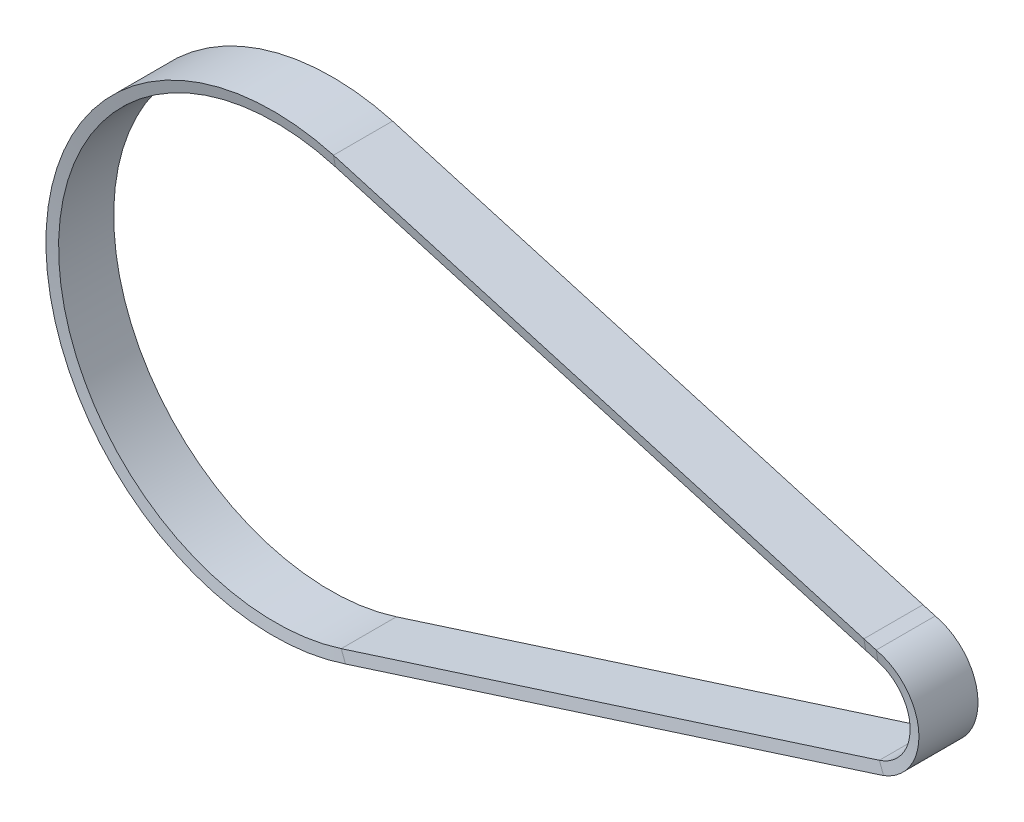
ISO-10303-21;
HEADER;
FILE_DESCRIPTION(('STEP AP214'),'2;1');
FILE_NAME('part.step','',(''),(''),'','','');
FILE_SCHEMA(('AUTOMOTIVE_DESIGN { 1 0 10303 214 1 1 1 1 }'));
ENDSEC;
DATA;
#1=APPLICATION_CONTEXT('core data for automotive mechanical design processes');
#2=APPLICATION_PROTOCOL_DEFINITION('international standard','automotive_design',2000,#1);
#3=PRODUCT_CONTEXT('',#1,'mechanical');
#4=PRODUCT('Part','Part','',(#3));
#5=PRODUCT_RELATED_PRODUCT_CATEGORY('part','',(#4));
#6=PRODUCT_DEFINITION_FORMATION('','',#4);
#7=PRODUCT_DEFINITION_CONTEXT('part definition',#1,'design');
#8=PRODUCT_DEFINITION('design','',#6,#7);
#9=PRODUCT_DEFINITION_SHAPE('','',#8);
#10=(LENGTH_UNIT() NAMED_UNIT(*) SI_UNIT(.MILLI.,.METRE.));
#11=(NAMED_UNIT(*) PLANE_ANGLE_UNIT() SI_UNIT($,.RADIAN.));
#12=(NAMED_UNIT(*) SI_UNIT($,.STERADIAN.) SOLID_ANGLE_UNIT());
#13=UNCERTAINTY_MEASURE_WITH_UNIT(LENGTH_MEASURE(1.E-05),#10,'distance_accuracy_value','');
#14=(GEOMETRIC_REPRESENTATION_CONTEXT(3) GLOBAL_UNCERTAINTY_ASSIGNED_CONTEXT((#13)) GLOBAL_UNIT_ASSIGNED_CONTEXT((#10,
#11,#12)) REPRESENTATION_CONTEXT('',''));
#15=CARTESIAN_POINT('',(0.,0.,0.));
#16=DIRECTION('',(0.,0.,1.));
#17=DIRECTION('',(1.,0.,0.));
#18=AXIS2_PLACEMENT_3D('',#15,#16,#17);
#19=CARTESIAN_POINT('',(6.25963492102954,27.2517322455981,-15.));
#20=DIRECTION('',(0.0505015186430798,0.174359257796911,0.983386213974577));
#21=DIRECTION('',(0.,-0.984642633533098,0.17458202722218));
#22=AXIS2_PLACEMENT_3D('',#19,#20,#21);
#23=PLANE('',#22);
#24=DIRECTION('',(0.,0.984642633533098,-0.17458202722218));
#25=VECTOR('',#24,1.);
#26=CARTESIAN_POINT('',(6.25963492102966,27.2517322455981,-15.));
#27=LINE('',#26,#25);
#28=CARTESIAN_POINT('',(6.25963492102965,21.6117322455981,-14.));
#29=VERTEX_POINT('',#28);
#30=CARTESIAN_POINT('',(6.25963492102965,27.2517322455981,-15.));
#31=VERTEX_POINT('',#30);
#32=EDGE_CURVE('E172',#29,#31,#27,.T.);
#33=ORIENTED_EDGE('',*,*,#32,.F.);
#34=DIRECTION('',(-0.960521433137697,0.2782059964902,0.));
#35=VECTOR('',#34,1.);
#36=CARTESIAN_POINT('',(6.25963492102954,21.6117322455981,-14.));
#37=LINE('',#36,#35);
#38=CARTESIAN_POINT('',(0.,23.4247766096173,-14.));
#39=VERTEX_POINT('',#38);
#40=EDGE_CURVE('E171',#29,#39,#37,.T.);
#41=ORIENTED_EDGE('',*,*,#40,.T.);
#42=DIRECTION('',(0.,0.984642633533098,-0.17458202722218));
#43=VECTOR('',#42,1.);
#44=CARTESIAN_POINT('',(0.,29.0647766096173,-15.));
#45=LINE('',#44,#43);
#46=CARTESIAN_POINT('',(0.,29.0647766096173,-15.));
#47=VERTEX_POINT('',#46);
#48=EDGE_CURVE('E146',#39,#47,#45,.T.);
#49=ORIENTED_EDGE('',*,*,#48,.T.);
#50=DIRECTION('',(-0.960521433137697,0.2782059964902,0.));
#51=VECTOR('',#50,1.);
#52=CARTESIAN_POINT('',(6.25963492102954,27.2517322455981,-15.));
#53=LINE('',#52,#51);
#54=EDGE_CURVE('E176',#31,#47,#53,.T.);
#55=ORIENTED_EDGE('',*,*,#54,.F.);
#56=EDGE_LOOP('',(#33,#41,#49,#55));
#57=FACE_BOUND('',#56,.T.);
#58=ADVANCED_FACE('F38',(#57),#23,.F.);
#59=CARTESIAN_POINT('',(0.,29.0647766096173,-15.));
#60=DIRECTION('',(0.0505015186430798,0.174359257796911,0.983386213974577));
#61=DIRECTION('',(0.,-0.984642633533098,0.17458202722218));
#62=AXIS2_PLACEMENT_3D('',#59,#60,#61);
#63=PLANE('',#62);
#64=DIRECTION('',(-0.960521433137697,0.2782059964902,0.));
#65=VECTOR('',#64,1.);
#66=CARTESIAN_POINT('',(0.,29.0647766096173,-15.));
#67=LINE('',#66,#65);
#68=CARTESIAN_POINT('',(-269.3677602481,107.084614144479,-15.));
#69=VERTEX_POINT('',#68);
#70=EDGE_CURVE('E152',#47,#69,#67,.T.);
#71=ORIENTED_EDGE('',*,*,#70,.F.);
#72=ORIENTED_EDGE('',*,*,#48,.F.);
#73=DIRECTION('',(-0.960521433137697,0.2782059964902,0.));
#74=VECTOR('',#73,1.);
#75=CARTESIAN_POINT('',(0.,23.4247766096173,-14.));
#76=LINE('',#75,#74);
#77=CARTESIAN_POINT('',(-269.3677602481,101.444614144479,-14.));
#78=VERTEX_POINT('',#77);
#79=EDGE_CURVE('E150',#39,#78,#76,.T.);
#80=ORIENTED_EDGE('',*,*,#79,.T.);
#81=DIRECTION('',(0.,0.984642633533098,-0.17458202722218));
#82=VECTOR('',#81,1.);
#83=CARTESIAN_POINT('',(-269.3677602481,107.084614144479,-15.));
#84=LINE('',#83,#82);
#85=EDGE_CURVE('E168',#78,#69,#84,.T.);
#86=ORIENTED_EDGE('',*,*,#85,.T.);
#87=EDGE_LOOP('',(#71,#72,#80,#86));
#88=FACE_BOUND('',#87,.T.);
#89=ADVANCED_FACE('F148',(#88),#63,.F.);
#90=CARTESIAN_POINT('',(0.,29.0647766096173,15.));
#91=DIRECTION('',(-0.2782059964902,-0.960521433137697,0.));
#92=DIRECTION('',(0.960521433137697,-0.2782059964902,0.));
#93=AXIS2_PLACEMENT_3D('',#90,#91,#92);
#94=PLANE('',#93);
#95=DIRECTION('',(-0.960521433137697,0.2782059964902,0.));
#96=VECTOR('',#95,1.);
#97=CARTESIAN_POINT('',(0.,29.0647766096173,15.));
#98=LINE('',#97,#96);
#99=CARTESIAN_POINT('',(0.,29.0647766096173,15.));
#100=VERTEX_POINT('',#99);
#101=CARTESIAN_POINT('',(-269.3677602481,107.084614144479,15.));
#102=VERTEX_POINT('',#101);
#103=EDGE_CURVE('E213',#100,#102,#98,.T.);
#104=ORIENTED_EDGE('',*,*,#103,.F.);
#105=DIRECTION('',(0.,0.,1.));
#106=VECTOR('',#105,1.);
#107=CARTESIAN_POINT('',(0.,29.0647766096173,15.));
#108=LINE('',#107,#106);
#109=EDGE_CURVE('E157',#47,#100,#108,.T.);
#110=ORIENTED_EDGE('',*,*,#109,.F.);
#111=ORIENTED_EDGE('',*,*,#70,.T.);
#112=DIRECTION('',(0.,0.,1.));
#113=VECTOR('',#112,1.);
#114=CARTESIAN_POINT('',(-269.3677602481,107.084614144479,15.));
#115=LINE('',#114,#113);
#116=EDGE_CURVE('E245',#69,#102,#115,.T.);
#117=ORIENTED_EDGE('',*,*,#116,.T.);
#118=EDGE_LOOP('',(#104,#110,#111,#117));
#119=FACE_BOUND('',#118,.T.);
#120=ADVANCED_FACE('F263',(#119),#94,.F.);
#121=CARTESIAN_POINT('',(0.,23.4247766096173,14.));
#122=DIRECTION('',(0.0505015186430798,0.174359257796911,-0.983386213974577));
#123=DIRECTION('',(0.,0.984642633533098,0.17458202722218));
#124=AXIS2_PLACEMENT_3D('',#121,#122,#123);
#125=PLANE('',#124);
#126=DIRECTION('',(-0.960521433137697,0.2782059964902,0.));
#127=VECTOR('',#126,1.);
#128=CARTESIAN_POINT('',(0.,23.4247766096173,14.));
#129=LINE('',#128,#127);
#130=CARTESIAN_POINT('',(0.,23.4247766096173,14.));
#131=VERTEX_POINT('',#130);
#132=CARTESIAN_POINT('',(-269.3677602481,101.444614144479,14.));
#133=VERTEX_POINT('',#132);
#134=EDGE_CURVE('E187',#131,#133,#129,.T.);
#135=ORIENTED_EDGE('',*,*,#134,.F.);
#136=DIRECTION('',(0.,-0.984642633533098,-0.17458202722218));
#137=VECTOR('',#136,1.);
#138=CARTESIAN_POINT('',(0.,23.4247766096173,14.));
#139=LINE('',#138,#137);
#140=EDGE_CURVE('E179',#100,#131,#139,.T.);
#141=ORIENTED_EDGE('',*,*,#140,.F.);
#142=ORIENTED_EDGE('',*,*,#103,.T.);
#143=DIRECTION('',(0.,-0.984642633533098,-0.17458202722218));
#144=VECTOR('',#143,1.);
#145=CARTESIAN_POINT('',(-269.3677602481,101.444614144479,14.));
#146=LINE('',#145,#144);
#147=EDGE_CURVE('E215',#102,#133,#146,.T.);
#148=ORIENTED_EDGE('',*,*,#147,.T.);
#149=EDGE_LOOP('',(#135,#141,#142,#148));
#150=FACE_BOUND('',#149,.T.);
#151=ADVANCED_FACE('F211',(#150),#125,.F.);
#152=CARTESIAN_POINT('',(0.,23.4247766096173,-14.));
#153=DIRECTION('',(0.2782059964902,0.960521433137697,0.));
#154=DIRECTION('',(-0.960521433137697,0.2782059964902,0.));
#155=AXIS2_PLACEMENT_3D('',#152,#153,#154);
#156=PLANE('',#155);
#157=DIRECTION('',(0.,0.,-1.));
#158=VECTOR('',#157,1.);
#159=CARTESIAN_POINT('',(-269.3677602481,101.444614144479,-14.));
#160=LINE('',#159,#158);
#161=EDGE_CURVE('E166',#133,#78,#160,.T.);
#162=ORIENTED_EDGE('',*,*,#161,.T.);
#163=ORIENTED_EDGE('',*,*,#79,.F.);
#164=DIRECTION('',(0.,0.,-1.));
#165=VECTOR('',#164,1.);
#166=CARTESIAN_POINT('',(0.,23.4247766096173,-14.));
#167=LINE('',#166,#165);
#168=EDGE_CURVE('E164',#131,#39,#167,.T.);
#169=ORIENTED_EDGE('',*,*,#168,.F.);
#170=ORIENTED_EDGE('',*,*,#134,.T.);
#171=EDGE_LOOP('',(#162,#163,#169,#170));
#172=FACE_BOUND('',#171,.T.);
#173=ADVANCED_FACE('F162',(#172),#156,.F.);
#174=CARTESIAN_POINT('',(-269.3677602481,101.444614144479,-14.));
#175=CARTESIAN_POINT('',(-346.902912762118,123.901941616827,-14.));
#176=CARTESIAN_POINT('',(-411.09310989075,74.9565636413775,-14.));
#177=CARTESIAN_POINT('',(-409.95957381143,-5.75741611757874,-14.));
#178=CARTESIAN_POINT('',(-408.826037732109,-86.471395876535,-14.));
#179=CARTESIAN_POINT('',(-343.286662806537,-133.594869506326,-14.));
#180=CARTESIAN_POINT('',(-266.412739672123,-108.969042119283,-14.));
#181=CARTESIAN_POINT('',(-269.3677602481,107.084614144479,-15.));
#182=CARTESIAN_POINT('',(-351.041746724327,129.541941616827,-15.));
#183=CARTESIAN_POINT('',(-417.695042729522,77.2704412006036,-15.));
#184=CARTESIAN_POINT('',(-415.354346744557,-7.40241611757875,-15.));
#185=CARTESIAN_POINT('',(-413.013650759592,-92.0752734357611,-15.));
#186=CARTESIAN_POINT('',(-343.574369279463,-140.584631415874,-15.));
#187=CARTESIAN_POINT('',(-263.265788794465,-113.649458785949,-15.));
#188=(BOUNDED_SURFACE() B_SPLINE_SURFACE(1,3,((#174,#175,#176,#177,#178,#179,#180),(#181,#182,
#183,#184,#185,#186,#187)),.UNSPECIFIED.,.F.,.F.,.F.) B_SPLINE_SURFACE_WITH_KNOTS((2,2),(4,3,4),
(0.,1.),(0.,0.5,1.),
.UNSPECIFIED.) GEOMETRIC_REPRESENTATION_ITEM() RATIONAL_B_SPLINE_SURFACE(((1.,0.730079357141269,
0.730079357141269,1.,0.730079357141269,0.730079357141269,1.),(1.,0.730079357141269,
0.730079357141269,1.,0.730079357141269,0.730079357141269,1.))) REPRESENTATION_ITEM('') SURFACE());
#189=CARTESIAN_POINT('',(-299.970419862022,-4.2127435006675,-15.));
#190=DIRECTION('',(0.,0.,1.));
#191=DIRECTION('',(0.265123349571637,0.96421450389004,0.));
#192=AXIS2_PLACEMENT_3D('',#189,#190,#191);
#193=CIRCLE('',#192,115.428006108731);
#194=CARTESIAN_POINT('',(-263.265788794465,-113.649458785949,-15.));
#195=VERTEX_POINT('',#194);
#196=EDGE_CURVE('E131',#69,#195,#193,.T.);
#197=CARTESIAN_POINT('',(-299.970419862022,-4.2127435006675,-14.));
#198=DIRECTION('',(0.,0.,1.));
#199=DIRECTION('',(0.278205996490201,0.960521433137696,0.));
#200=AXIS2_PLACEMENT_3D('',#197,#198,#199);
#201=CIRCLE('',#200,110.);
#202=CARTESIAN_POINT('',(-266.412739672123,-108.969042119282,-14.));
#203=VERTEX_POINT('',#202);
#204=EDGE_CURVE('E186',#78,#203,#201,.T.);
#205=DIRECTION('',(0.549401063790055,-0.817116629911147,-0.17458202722218));
#206=VECTOR('',#205,1.);
#207=CARTESIAN_POINT('',(-263.265788794465,-113.649458785949,-15.));
#208=LINE('',#207,#206);
#209=EDGE_CURVE('E222',#203,#195,#208,.T.);
#210=ORIENTED_EDGE('',*,*,#196,.F.);
#211=ORIENTED_EDGE('',*,*,#85,.F.);
#212=ORIENTED_EDGE('',*,*,#204,.T.);
#213=ORIENTED_EDGE('',*,*,#209,.T.);
#214=EDGE_LOOP('',(#210,#211,#212,#213));
#215=FACE_BOUND('',#214,.T.);
#216=ADVANCED_FACE('F295',(#215),#188,.F.);
#217=CARTESIAN_POINT('',(-299.970419862022,-4.2127435006675,0.));
#218=DIRECTION('',(0.,0.,1.));
#219=DIRECTION('',(1.,0.,0.));
#220=AXIS2_PLACEMENT_3D('',#217,#218,#219);
#221=CYLINDRICAL_SURFACE('',#220,115.428006108731);
#222=CARTESIAN_POINT('',(-299.970419862022,-4.2127435006675,15.));
#223=DIRECTION('',(0.,0.,1.));
#224=DIRECTION('',(0.265123349571637,0.96421450389004,0.));
#225=AXIS2_PLACEMENT_3D('',#222,#223,#224);
#226=CIRCLE('',#225,115.428006108731);
#227=CARTESIAN_POINT('',(-263.265788794465,-113.649458785949,15.));
#228=VERTEX_POINT('',#227);
#229=EDGE_CURVE('E125',#102,#228,#226,.T.);
#230=ORIENTED_EDGE('',*,*,#229,.F.);
#231=ORIENTED_EDGE('',*,*,#116,.F.);
#232=ORIENTED_EDGE('',*,*,#196,.T.);
#233=DIRECTION('',(0.,0.,1.));
#234=VECTOR('',#233,1.);
#235=CARTESIAN_POINT('',(-263.265788794465,-113.649458785949,15.));
#236=LINE('',#235,#234);
#237=EDGE_CURVE('E220',#195,#228,#236,.T.);
#238=ORIENTED_EDGE('',*,*,#237,.T.);
#239=EDGE_LOOP('',(#230,#231,#232,#238));
#240=FACE_BOUND('',#239,.T.);
#241=ADVANCED_FACE('F299',(#240),#221,.T.);
#242=CARTESIAN_POINT('',(-269.3677602481,107.084614144479,15.));
#243=CARTESIAN_POINT('',(-351.041746724327,129.541941616827,15.));
#244=CARTESIAN_POINT('',(-417.695042729522,77.2704412006036,15.));
#245=CARTESIAN_POINT('',(-415.354346744557,-7.40241611757875,15.));
#246=CARTESIAN_POINT('',(-413.013650759592,-92.0752734357611,15.));
#247=CARTESIAN_POINT('',(-343.574369279463,-140.584631415874,15.));
#248=CARTESIAN_POINT('',(-263.265788794465,-113.649458785949,15.));
#249=CARTESIAN_POINT('',(-269.3677602481,101.444614144479,14.));
#250=CARTESIAN_POINT('',(-346.902912762118,123.901941616827,14.));
#251=CARTESIAN_POINT('',(-411.09310989075,74.9565636413775,14.));
#252=CARTESIAN_POINT('',(-409.95957381143,-5.75741611757874,14.));
#253=CARTESIAN_POINT('',(-408.826037732109,-86.471395876535,14.));
#254=CARTESIAN_POINT('',(-343.286662806537,-133.594869506326,14.));
#255=CARTESIAN_POINT('',(-266.412739672123,-108.969042119283,14.));
#256=(BOUNDED_SURFACE() B_SPLINE_SURFACE(1,3,((#242,#243,#244,#245,#246,#247,#248),(#249,#250,
#251,#252,#253,#254,#255)),.UNSPECIFIED.,.F.,.F.,.F.) B_SPLINE_SURFACE_WITH_KNOTS((2,2),(4,3,4),
(0.,1.),(0.,0.5,1.),
.UNSPECIFIED.) GEOMETRIC_REPRESENTATION_ITEM() RATIONAL_B_SPLINE_SURFACE(((1.,0.730079357141269,
0.730079357141269,1.,0.730079357141269,0.730079357141269,1.),(1.,0.730079357141269,
0.730079357141269,1.,0.730079357141269,0.730079357141269,1.))) REPRESENTATION_ITEM('') SURFACE());
#257=CARTESIAN_POINT('',(-299.970419862022,-4.2127435006675,14.));
#258=DIRECTION('',(0.,0.,1.));
#259=DIRECTION('',(0.278205996490201,0.960521433137696,0.));
#260=AXIS2_PLACEMENT_3D('',#257,#258,#259);
#261=CIRCLE('',#260,110.);
#262=CARTESIAN_POINT('',(-266.412739672123,-108.969042119282,14.));
#263=VERTEX_POINT('',#262);
#264=EDGE_CURVE('E221',#133,#263,#261,.T.);
#265=DIRECTION('',(-0.549401063790055,0.817116629911147,-0.17458202722218));
#266=VECTOR('',#265,1.);
#267=CARTESIAN_POINT('',(-266.412739672122,-108.969042119282,14.));
#268=LINE('',#267,#266);
#269=EDGE_CURVE('E191',#228,#263,#268,.T.);
#270=ORIENTED_EDGE('',*,*,#264,.F.);
#271=ORIENTED_EDGE('',*,*,#147,.F.);
#272=ORIENTED_EDGE('',*,*,#229,.T.);
#273=ORIENTED_EDGE('',*,*,#269,.T.);
#274=EDGE_LOOP('',(#270,#271,#272,#273));
#275=FACE_BOUND('',#274,.T.);
#276=ADVANCED_FACE('F310',(#275),#256,.F.);
#277=CARTESIAN_POINT('',(-299.970419862022,-4.2127435006675,0.));
#278=DIRECTION('',(0.,0.,1.));
#279=DIRECTION('',(1.,0.,0.));
#280=AXIS2_PLACEMENT_3D('',#277,#278,#279);
#281=CYLINDRICAL_SURFACE('',#280,110.);
#282=DIRECTION('',(0.,0.,-1.));
#283=VECTOR('',#282,1.);
#284=CARTESIAN_POINT('',(-266.412739672122,-108.969042119282,-14.));
#285=LINE('',#284,#283);
#286=EDGE_CURVE('E188',#263,#203,#285,.T.);
#287=ORIENTED_EDGE('',*,*,#286,.T.);
#288=ORIENTED_EDGE('',*,*,#204,.F.);
#289=ORIENTED_EDGE('',*,*,#161,.F.);
#290=ORIENTED_EDGE('',*,*,#264,.T.);
#291=EDGE_LOOP('',(#287,#288,#289,#290));
#292=FACE_BOUND('',#291,.T.);
#293=ADVANCED_FACE('F293',(#292),#281,.F.);
#294=CARTESIAN_POINT('',(-263.265788794465,-113.649458785949,-15.));
#295=DIRECTION('',(0.0553779910997586,-0.17287230046049,0.983386213974577));
#296=DIRECTION('',(0.,-0.984897577080484,-0.173137987342446));
#297=AXIS2_PLACEMENT_3D('',#294,#295,#296);
#298=PLANE('',#297);
#299=DIRECTION('',(0.952329987441954,0.305069819908176,0.));
#300=VECTOR('',#299,1.);
#301=CARTESIAN_POINT('',(-263.265788794465,-113.649458785949,-15.));
#302=LINE('',#301,#300);
#303=CARTESIAN_POINT('',(10.011021825591,-26.1078413841108,-15.));
#304=VERTEX_POINT('',#303);
#305=EDGE_CURVE('E108',#195,#304,#302,.T.);
#306=ORIENTED_EDGE('',*,*,#305,.F.);
#307=ORIENTED_EDGE('',*,*,#209,.F.);
#308=DIRECTION('',(0.952329987441954,0.305069819908176,0.));
#309=VECTOR('',#308,1.);
#310=CARTESIAN_POINT('',(-266.412739672122,-108.969042119283,-14.));
#311=LINE('',#310,#309);
#312=CARTESIAN_POINT('',(6.86407094793362,-21.4274247174441,-14.));
#313=VERTEX_POINT('',#312);
#314=EDGE_CURVE('E190',#203,#313,#311,.T.);
#315=ORIENTED_EDGE('',*,*,#314,.T.);
#316=DIRECTION('',(0.549401063790055,-0.817116629911147,-0.17458202722218));
#317=VECTOR('',#316,1.);
#318=CARTESIAN_POINT('',(10.0110218255911,-26.1078413841107,-15.));
#319=LINE('',#318,#317);
#320=EDGE_CURVE('E251',#313,#304,#319,.T.);
#321=ORIENTED_EDGE('',*,*,#320,.T.);
#322=EDGE_LOOP('',(#306,#307,#315,#321));
#323=FACE_BOUND('',#322,.T.);
#324=ADVANCED_FACE('F284',(#323),#298,.F.);
#325=CARTESIAN_POINT('',(-263.265788794465,-113.649458785949,15.));
#326=DIRECTION('',(-0.305069819908176,0.952329987441954,0.));
#327=DIRECTION('',(-0.952329987441955,-0.305069819908176,0.));
#328=AXIS2_PLACEMENT_3D('',#325,#326,#327);
#329=PLANE('',#328);
#330=DIRECTION('',(0.952329987441954,0.305069819908176,0.));
#331=VECTOR('',#330,1.);
#332=CARTESIAN_POINT('',(-263.265788794465,-113.649458785949,15.));
#333=LINE('',#332,#331);
#334=CARTESIAN_POINT('',(10.011021825591,-26.1078413841108,15.));
#335=VERTEX_POINT('',#334);
#336=EDGE_CURVE('E101',#228,#335,#333,.T.);
#337=ORIENTED_EDGE('',*,*,#336,.F.);
#338=ORIENTED_EDGE('',*,*,#237,.F.);
#339=ORIENTED_EDGE('',*,*,#305,.T.);
#340=DIRECTION('',(0.,0.,1.));
#341=VECTOR('',#340,1.);
#342=CARTESIAN_POINT('',(10.0110218255911,-26.1078413841107,15.));
#343=LINE('',#342,#341);
#344=EDGE_CURVE('E230',#304,#335,#343,.T.);
#345=ORIENTED_EDGE('',*,*,#344,.T.);
#346=EDGE_LOOP('',(#337,#338,#339,#345));
#347=FACE_BOUND('',#346,.T.);
#348=ADVANCED_FACE('F292',(#347),#329,.F.);
#349=CARTESIAN_POINT('',(-266.412739672122,-108.969042119283,14.));
#350=DIRECTION('',(0.0553779910997586,-0.17287230046049,-0.983386213974577));
#351=DIRECTION('',(0.,0.984897577080484,-0.173137987342446));
#352=AXIS2_PLACEMENT_3D('',#349,#350,#351);
#353=PLANE('',#352);
#354=DIRECTION('',(0.952329987441954,0.305069819908176,0.));
#355=VECTOR('',#354,1.);
#356=CARTESIAN_POINT('',(-266.412739672122,-108.969042119283,14.));
#357=LINE('',#356,#355);
#358=CARTESIAN_POINT('',(6.86407094793362,-21.4274247174441,14.));
#359=VERTEX_POINT('',#358);
#360=EDGE_CURVE('E92',#263,#359,#357,.T.);
#361=ORIENTED_EDGE('',*,*,#360,.F.);
#362=ORIENTED_EDGE('',*,*,#269,.F.);
#363=ORIENTED_EDGE('',*,*,#336,.T.);
#364=DIRECTION('',(-0.549401063790054,0.817116629911147,-0.17458202722218));
#365=VECTOR('',#364,1.);
#366=CARTESIAN_POINT('',(6.86407094793367,-21.4274247174441,14.));
#367=LINE('',#366,#365);
#368=EDGE_CURVE('E197',#335,#359,#367,.T.);
#369=ORIENTED_EDGE('',*,*,#368,.T.);
#370=EDGE_LOOP('',(#361,#362,#363,#369));
#371=FACE_BOUND('',#370,.T.);
#372=ADVANCED_FACE('F313',(#371),#353,.F.);
#373=CARTESIAN_POINT('',(-266.412739672122,-108.969042119283,-14.));
#374=DIRECTION('',(0.305069819908176,-0.952329987441954,0.));
#375=DIRECTION('',(0.952329987441955,0.305069819908176,0.));
#376=AXIS2_PLACEMENT_3D('',#373,#374,#375);
#377=PLANE('',#376);
#378=DIRECTION('',(0.,0.,-1.));
#379=VECTOR('',#378,1.);
#380=CARTESIAN_POINT('',(6.86407094793367,-21.4274247174441,-14.));
#381=LINE('',#380,#379);
#382=EDGE_CURVE('E192',#359,#313,#381,.T.);
#383=ORIENTED_EDGE('',*,*,#382,.T.);
#384=ORIENTED_EDGE('',*,*,#314,.F.);
#385=ORIENTED_EDGE('',*,*,#286,.F.);
#386=ORIENTED_EDGE('',*,*,#360,.T.);
#387=EDGE_LOOP('',(#383,#384,#385,#386));
#388=FACE_BOUND('',#387,.T.);
#389=ADVANCED_FACE('F283',(#388),#377,.F.);
#390=CARTESIAN_POINT('',(6.86407094793371,-21.427424717444,-14.));
#391=CARTESIAN_POINT('',(32.7534530066761,-13.134008332007,-14.));
#392=CARTESIAN_POINT('',(32.3717039370524,14.0486171183355,-14.));
#393=CARTESIAN_POINT('',(6.25963492102961,21.6117322455981,-14.));
#394=CARTESIAN_POINT('',(10.0110218255911,-26.1078413841107,-15.));
#395=CARTESIAN_POINT('',(41.5554509501991,-14.0121662267438,-15.));
#396=CARTESIAN_POINT('',(39.1861539578445,19.6886171183355,-15.));
#397=CARTESIAN_POINT('',(6.25963492102961,27.2517322455981,-15.));
#398=(BOUNDED_SURFACE() B_SPLINE_SURFACE(1,3,((#390,#391,#392,#393),(#394,#395,#396,#397)),
.UNSPECIFIED.,.F.,.F.,.F.) B_SPLINE_SURFACE_WITH_KNOTS((2,2),(4,4),(0.,1.),(0.,1.),
.UNSPECIFIED.) GEOMETRIC_REPRESENTATION_ITEM() RATIONAL_B_SPLINE_SURFACE(((1.,0.527777777777776,
0.527777777777776,1.),(1.,0.527777777777776,0.527777777777776,1.))) REPRESENTATION_ITEM('') SURFACE());
#399=CARTESIAN_POINT('',(0.,0.,-15.));
#400=DIRECTION('',(0.,0.,1.));
#401=DIRECTION('',(0.358030052391885,-0.933710062912607,0.));
#402=AXIS2_PLACEMENT_3D('',#399,#400,#401);
#403=CIRCLE('',#402,27.9614008899831);
#404=EDGE_CURVE('E235',#304,#31,#403,.T.);
#405=CARTESIAN_POINT('',(0.,0.,-14.));
#406=DIRECTION('',(0.,0.,1.));
#407=DIRECTION('',(0.305069819908165,-0.952329987441958,0.));
#408=AXIS2_PLACEMENT_3D('',#405,#406,#407);
#409=CIRCLE('',#408,22.5);
#410=EDGE_CURVE('E193',#313,#29,#409,.T.);
#411=ORIENTED_EDGE('',*,*,#404,.F.);
#412=ORIENTED_EDGE('',*,*,#320,.F.);
#413=ORIENTED_EDGE('',*,*,#410,.T.);
#414=ORIENTED_EDGE('',*,*,#32,.T.);
#415=EDGE_LOOP('',(#411,#412,#413,#414));
#416=FACE_BOUND('',#415,.T.);
#417=ADVANCED_FACE('F278',(#416),#398,.F.);
#418=CARTESIAN_POINT('',(0.,0.,0.));
#419=DIRECTION('',(0.,0.,1.));
#420=DIRECTION('',(1.,0.,0.));
#421=AXIS2_PLACEMENT_3D('',#418,#419,#420);
#422=CYLINDRICAL_SURFACE('',#421,27.9614008899831);
#423=CARTESIAN_POINT('',(0.,0.,15.));
#424=DIRECTION('',(0.,0.,1.));
#425=DIRECTION('',(0.358030052391885,-0.933710062912607,0.));
#426=AXIS2_PLACEMENT_3D('',#423,#424,#425);
#427=CIRCLE('',#426,27.9614008899831);
#428=CARTESIAN_POINT('',(6.25963492102966,27.2517322455981,15.));
#429=VERTEX_POINT('',#428);
#430=EDGE_CURVE('E63',#335,#429,#427,.T.);
#431=ORIENTED_EDGE('',*,*,#430,.F.);
#432=ORIENTED_EDGE('',*,*,#344,.F.);
#433=ORIENTED_EDGE('',*,*,#404,.T.);
#434=DIRECTION('',(0.,0.,1.));
#435=VECTOR('',#434,1.);
#436=CARTESIAN_POINT('',(6.25963492102966,27.2517322455981,15.));
#437=LINE('',#436,#435);
#438=EDGE_CURVE('E233',#31,#429,#437,.T.);
#439=ORIENTED_EDGE('',*,*,#438,.T.);
#440=EDGE_LOOP('',(#431,#432,#433,#439));
#441=FACE_BOUND('',#440,.T.);
#442=ADVANCED_FACE('F259',(#441),#422,.T.);
#443=CARTESIAN_POINT('',(10.0110218255911,-26.1078413841107,15.));
#444=CARTESIAN_POINT('',(41.5554509501991,-14.0121662267438,15.));
#445=CARTESIAN_POINT('',(39.1861539578445,19.6886171183355,15.));
#446=CARTESIAN_POINT('',(6.2596349210296,27.2517322455981,15.));
#447=CARTESIAN_POINT('',(6.86407094793371,-21.427424717444,14.));
#448=CARTESIAN_POINT('',(32.7534530066761,-13.134008332007,14.));
#449=CARTESIAN_POINT('',(32.3717039370524,14.0486171183355,14.));
#450=CARTESIAN_POINT('',(6.25963492102961,21.6117322455981,14.));
#451=(BOUNDED_SURFACE() B_SPLINE_SURFACE(1,3,((#443,#444,#445,#446),(#447,#448,#449,#450)),
.UNSPECIFIED.,.F.,.F.,.F.) B_SPLINE_SURFACE_WITH_KNOTS((2,2),(4,4),(0.,1.),(0.,1.),
.UNSPECIFIED.) GEOMETRIC_REPRESENTATION_ITEM() RATIONAL_B_SPLINE_SURFACE(((1.,0.527777777777776,
0.527777777777776,1.),(1.,0.527777777777776,0.527777777777776,1.))) REPRESENTATION_ITEM('') SURFACE());
#452=CARTESIAN_POINT('',(0.,0.,14.));
#453=DIRECTION('',(0.,0.,1.));
#454=DIRECTION('',(0.305069819908165,-0.952329987441958,0.));
#455=AXIS2_PLACEMENT_3D('',#452,#453,#454);
#456=CIRCLE('',#455,22.5);
#457=CARTESIAN_POINT('',(6.25963492102965,21.6117322455981,14.));
#458=VERTEX_POINT('',#457);
#459=EDGE_CURVE('E55',#359,#458,#456,.T.);
#460=DIRECTION('',(0.,-0.984642633533098,-0.17458202722218));
#461=VECTOR('',#460,1.);
#462=CARTESIAN_POINT('',(6.25963492102966,21.6117322455981,14.));
#463=LINE('',#462,#461);
#464=EDGE_CURVE('E202',#429,#458,#463,.T.);
#465=ORIENTED_EDGE('',*,*,#459,.F.);
#466=ORIENTED_EDGE('',*,*,#368,.F.);
#467=ORIENTED_EDGE('',*,*,#430,.T.);
#468=ORIENTED_EDGE('',*,*,#464,.T.);
#469=EDGE_LOOP('',(#465,#466,#467,#468));
#470=FACE_BOUND('',#469,.T.);
#471=ADVANCED_FACE('F322',(#470),#451,.F.);
#472=CARTESIAN_POINT('',(0.,0.,0.));
#473=DIRECTION('',(0.,0.,1.));
#474=DIRECTION('',(1.,0.,0.));
#475=AXIS2_PLACEMENT_3D('',#472,#473,#474);
#476=CYLINDRICAL_SURFACE('',#475,22.5);
#477=DIRECTION('',(0.,0.,-1.));
#478=VECTOR('',#477,1.);
#479=CARTESIAN_POINT('',(6.25963492102966,21.6117322455981,-14.));
#480=LINE('',#479,#478);
#481=EDGE_CURVE('E42',#458,#29,#480,.T.);
#482=ORIENTED_EDGE('',*,*,#481,.T.);
#483=ORIENTED_EDGE('',*,*,#410,.F.);
#484=ORIENTED_EDGE('',*,*,#382,.F.);
#485=ORIENTED_EDGE('',*,*,#459,.T.);
#486=EDGE_LOOP('',(#482,#483,#484,#485));
#487=FACE_BOUND('',#486,.T.);
#488=ADVANCED_FACE('F203',(#487),#476,.F.);
#489=CARTESIAN_POINT('',(6.25963492102954,27.2517322455981,15.));
#490=DIRECTION('',(-0.2782059964902,-0.960521433137697,0.));
#491=DIRECTION('',(0.960521433137697,-0.2782059964902,0.));
#492=AXIS2_PLACEMENT_3D('',#489,#490,#491);
#493=PLANE('',#492);
#494=ORIENTED_EDGE('',*,*,#54,.T.);
#495=ORIENTED_EDGE('',*,*,#109,.T.);
#496=DIRECTION('',(-0.960521433137697,0.2782059964902,0.));
#497=VECTOR('',#496,1.);
#498=CARTESIAN_POINT('',(6.25963492102954,27.2517322455981,15.));
#499=LINE('',#498,#497);
#500=EDGE_CURVE('E47',#429,#100,#499,.T.);
#501=ORIENTED_EDGE('',*,*,#500,.F.);
#502=ORIENTED_EDGE('',*,*,#438,.F.);
#503=EDGE_LOOP('',(#494,#495,#501,#502));
#504=FACE_BOUND('',#503,.T.);
#505=ADVANCED_FACE('F262',(#504),#493,.F.);
#506=CARTESIAN_POINT('',(6.25963492102954,21.6117322455981,14.));
#507=DIRECTION('',(0.0505015186430798,0.174359257796911,-0.983386213974577));
#508=DIRECTION('',(0.,0.984642633533098,0.17458202722218));
#509=AXIS2_PLACEMENT_3D('',#506,#507,#508);
#510=PLANE('',#509);
#511=ORIENTED_EDGE('',*,*,#500,.T.);
#512=ORIENTED_EDGE('',*,*,#140,.T.);
#513=DIRECTION('',(-0.960521433137697,0.2782059964902,0.));
#514=VECTOR('',#513,1.);
#515=CARTESIAN_POINT('',(6.25963492102954,21.6117322455981,14.));
#516=LINE('',#515,#514);
#517=EDGE_CURVE('E11',#458,#131,#516,.T.);
#518=ORIENTED_EDGE('',*,*,#517,.F.);
#519=ORIENTED_EDGE('',*,*,#464,.F.);
#520=EDGE_LOOP('',(#511,#512,#518,#519));
#521=FACE_BOUND('',#520,.T.);
#522=ADVANCED_FACE('F207',(#521),#510,.F.);
#523=CARTESIAN_POINT('',(6.25963492102954,21.6117322455981,-14.));
#524=DIRECTION('',(0.2782059964902,0.960521433137697,0.));
#525=DIRECTION('',(-0.960521433137697,0.2782059964902,0.));
#526=AXIS2_PLACEMENT_3D('',#523,#524,#525);
#527=PLANE('',#526);
#528=ORIENTED_EDGE('',*,*,#517,.T.);
#529=ORIENTED_EDGE('',*,*,#168,.T.);
#530=ORIENTED_EDGE('',*,*,#40,.F.);
#531=ORIENTED_EDGE('',*,*,#481,.F.);
#532=EDGE_LOOP('',(#528,#529,#530,#531));
#533=FACE_BOUND('',#532,.T.);
#534=ADVANCED_FACE('F40',(#533),#527,.F.);
#535=CLOSED_SHELL('',(#58,#89,#120,#151,#173,#216,#241,#276,#293,#324,#348,#372,#389,#417,#442,
#471,#488,#505,#522,#534));
#536=MANIFOLD_SOLID_BREP('B2',#535);
#537=ADVANCED_BREP_SHAPE_REPRESENTATION('',(#18,#536),#14);
#538=SHAPE_DEFINITION_REPRESENTATION(#9,#537);
ENDSEC;
END-ISO-10303-21;
